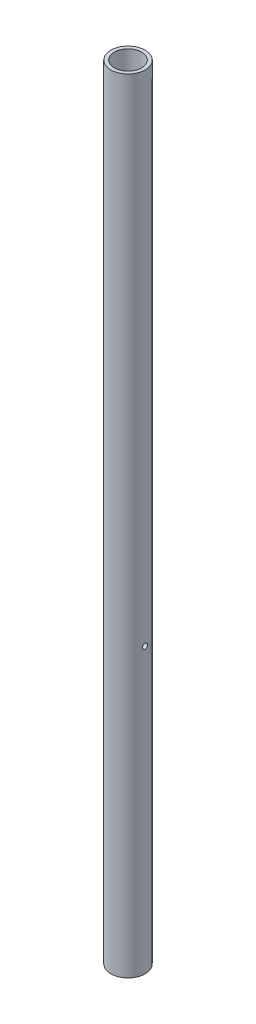
ISO-10303-21;
HEADER;
FILE_DESCRIPTION(('STEP AP214'),'2;1');
FILE_NAME('part.step','',(''),(''),'','','');
FILE_SCHEMA(('AUTOMOTIVE_DESIGN { 1 0 10303 214 1 1 1 1 }'));
ENDSEC;
DATA;
#1=APPLICATION_CONTEXT('core data for automotive mechanical design processes');
#2=APPLICATION_PROTOCOL_DEFINITION('international standard','automotive_design',2000,#1);
#3=PRODUCT_CONTEXT('',#1,'mechanical');
#4=PRODUCT('Part','Part','',(#3));
#5=PRODUCT_RELATED_PRODUCT_CATEGORY('part','',(#4));
#6=PRODUCT_DEFINITION_FORMATION('','',#4);
#7=PRODUCT_DEFINITION_CONTEXT('part definition',#1,'design');
#8=PRODUCT_DEFINITION('design','',#6,#7);
#9=PRODUCT_DEFINITION_SHAPE('','',#8);
#10=(LENGTH_UNIT() NAMED_UNIT(*) SI_UNIT(.MILLI.,.METRE.));
#11=(NAMED_UNIT(*) PLANE_ANGLE_UNIT() SI_UNIT($,.RADIAN.));
#12=(NAMED_UNIT(*) SI_UNIT($,.STERADIAN.) SOLID_ANGLE_UNIT());
#13=UNCERTAINTY_MEASURE_WITH_UNIT(LENGTH_MEASURE(1.E-05),#10,'distance_accuracy_value','');
#14=(GEOMETRIC_REPRESENTATION_CONTEXT(3) GLOBAL_UNCERTAINTY_ASSIGNED_CONTEXT((#13)) GLOBAL_UNIT_ASSIGNED_CONTEXT((#10,
#11,#12)) REPRESENTATION_CONTEXT('',''));
#15=CARTESIAN_POINT('',(0.,0.,0.));
#16=DIRECTION('',(0.,0.,1.));
#17=DIRECTION('',(1.,0.,0.));
#18=AXIS2_PLACEMENT_3D('',#15,#16,#17);
#19=CARTESIAN_POINT('',(0.,-762.,0.));
#20=DIRECTION('',(0.,-1.,0.));
#21=DIRECTION('',(0.,0.,-1.));
#22=AXIS2_PLACEMENT_3D('',#19,#20,#21);
#23=CYLINDRICAL_SURFACE('',#22,13.3223);
#24=CARTESIAN_POINT('',(13.094248102263,-485.896311896024,2.45445389575424));
#25=CARTESIAN_POINT('',(13.0955186791606,-486.033177573124,2.44768393004283));
#26=CARTESIAN_POINT('',(13.0989480892506,-486.169526439796,2.4294352910103));
#27=CARTESIAN_POINT('',(13.1097367075667,-486.437209912402,2.37051786913984));
#28=CARTESIAN_POINT('',(13.1170994419253,-486.568539905657,2.32982896807454));
#29=CARTESIAN_POINT('',(13.1348939660872,-486.822299777622,2.22731391930042));
#30=CARTESIAN_POINT('',(13.1453227891315,-486.944738117777,2.16550819498147));
#31=CARTESIAN_POINT('',(13.1680756823768,-487.177512251901,2.02254266967234));
#32=CARTESIAN_POINT('',(13.1803995743907,-487.287849182058,1.94138468791866));
#33=CARTESIAN_POINT('',(13.2057234855463,-487.494645934029,1.76094154937199));
#34=CARTESIAN_POINT('',(13.2187294693681,-487.590939011952,1.6614660675412));
#35=CARTESIAN_POINT('',(13.2438431523428,-487.765540017535,1.44770736090261));
#36=CARTESIAN_POINT('',(13.2559508092402,-487.843847099527,1.33342344022603));
#37=CARTESIAN_POINT('',(13.2779711460215,-487.980558991197,1.09262168331398));
#38=CARTESIAN_POINT('',(13.2878737084947,-488.038872701134,0.966051133833017));
#39=CARTESIAN_POINT('',(13.3042931753712,-488.133342398027,0.704688100131764));
#40=CARTESIAN_POINT('',(13.3108103916738,-488.169500426289,0.569896374625207));
#41=CARTESIAN_POINT('',(13.3196576802456,-488.218201770463,0.297791777038008));
#42=CARTESIAN_POINT('',(13.3220411477954,-488.231046327095,0.160534555414485));
#43=CARTESIAN_POINT('',(13.3225185635427,-488.233635255758,-0.114199369083345));
#44=CARTESIAN_POINT('',(13.320612802735,-488.223381194871,-0.251676056436081));
#45=CARTESIAN_POINT('',(13.3127670814004,-488.180324310705,-0.521490643613043));
#46=CARTESIAN_POINT('',(13.3068682001921,-488.147751055359,-0.653866501924989));
#47=CARTESIAN_POINT('',(13.2917238406163,-488.061286549074,-0.911256691554743));
#48=CARTESIAN_POINT('',(13.2824781892698,-488.007394196236,-1.03627064198143));
#49=CARTESIAN_POINT('',(13.2615545448244,-487.879333446472,-1.2765277909632));
#50=CARTESIAN_POINT('',(13.2498574086408,-487.805003943778,-1.39168339755751));
#51=CARTESIAN_POINT('',(13.2253497680949,-487.638340106305,-1.60800227237208));
#52=CARTESIAN_POINT('',(13.2125391564742,-487.546004035928,-1.70916419017576));
#53=CARTESIAN_POINT('',(13.1870191403829,-487.344387031095,-1.89611433058584));
#54=CARTESIAN_POINT('',(13.174313749858,-487.234884293187,-1.98166409678471));
#55=CARTESIAN_POINT('',(13.1506307052616,-487.002909114261,-2.13318810091533));
#56=CARTESIAN_POINT('',(13.139653034192,-486.880436800863,-2.19916253144319));
#57=CARTESIAN_POINT('',(13.1207076850191,-486.626110681478,-2.30951399379013));
#58=CARTESIAN_POINT('',(13.1127355479872,-486.494271120613,-2.35392304783903));
#59=CARTESIAN_POINT('',(13.1007201484129,-486.224827828475,-2.4199066158937));
#60=CARTESIAN_POINT('',(13.0966764426535,-486.087224749287,-2.44148370589223));
#61=CARTESIAN_POINT('',(13.0930297957402,-485.812418142652,-2.46096428621845));
#62=CARTESIAN_POINT('',(13.0933598135124,-485.675240752395,-2.4592251660184));
#63=CARTESIAN_POINT('',(13.0982585448134,-485.403160872828,-2.43299692449981));
#64=CARTESIAN_POINT('',(13.102827140668,-485.268258320467,-2.40850843476359));
#65=CARTESIAN_POINT('',(13.1156384395196,-485.005234531561,-2.33772922921322));
#66=CARTESIAN_POINT('',(13.1238623113673,-484.877082256356,-2.29155018981437));
#67=CARTESIAN_POINT('',(13.1430505289193,-484.630310832631,-2.17879644302104));
#68=CARTESIAN_POINT('',(13.1540151020374,-484.511692476283,-2.11222004302297));
#69=CARTESIAN_POINT('',(13.1776294191417,-484.285665395147,-1.95953712919564));
#70=CARTESIAN_POINT('',(13.1902993708158,-484.178424011737,-1.87318602326438));
#71=CARTESIAN_POINT('',(13.2158053161587,-483.979836377772,-1.6838273904015));
#72=CARTESIAN_POINT('',(13.2286413222502,-483.888491323911,-1.58081861058667));
#73=CARTESIAN_POINT('',(13.2532020222888,-483.723290680376,-1.35970569904997));
#74=CARTESIAN_POINT('',(13.2649130238339,-483.649637335378,-1.24144876751076));
#75=CARTESIAN_POINT('',(13.2857441158786,-483.523271462329,-0.994018659490983));
#76=CARTESIAN_POINT('',(13.2948643567712,-483.470557718668,-0.86484611722373));
#77=CARTESIAN_POINT('',(13.3094217348682,-483.388006336459,-0.60030643732196));
#78=CARTESIAN_POINT('',(13.3148873776677,-483.357991401892,-0.464996248088174));
#79=CARTESIAN_POINT('',(13.3216320835144,-483.321105000857,-0.191159340950899));
#80=CARTESIAN_POINT('',(13.3229115444872,-483.314231334649,-0.0526329300324671));
#81=CARTESIAN_POINT('',(13.3211526457135,-483.323774206487,0.221618653861091));
#82=CARTESIAN_POINT('',(13.3181750180303,-483.339863151953,0.3573557566275));
#83=CARTESIAN_POINT('',(13.3083407127711,-483.394238924374,0.624157971647902));
#84=CARTESIAN_POINT('',(13.3014839982312,-483.432525962855,0.755223039369327));
#85=CARTESIAN_POINT('',(13.2846305886335,-483.530206697619,1.00920899497344));
#86=CARTESIAN_POINT('',(13.2746297686051,-483.589628135117,1.13211892553627));
#87=CARTESIAN_POINT('',(13.2525755283095,-483.727860352105,1.36629823432814));
#88=CARTESIAN_POINT('',(13.2405219630152,-483.80667250173,1.47756678919203));
#89=CARTESIAN_POINT('',(13.2154775732462,-483.982816179109,1.68705018368411));
#90=CARTESIAN_POINT('',(13.2024755936137,-484.080402413967,1.78504959049889));
#91=CARTESIAN_POINT('',(13.1771372509761,-484.290681627771,1.96338146001378));
#92=CARTESIAN_POINT('',(13.1648010332379,-484.403377885125,2.04371007868295));
#93=CARTESIAN_POINT('',(13.1421167957647,-484.641535513222,2.18485751769197));
#94=CARTESIAN_POINT('',(13.1317816720822,-484.767072199748,2.24555137951654));
#95=CARTESIAN_POINT('',(13.1144130806487,-485.026718256206,2.34487018117609));
#96=CARTESIAN_POINT('',(13.1073764000531,-485.160819138881,2.38351660429228));
#97=CARTESIAN_POINT('',(13.0988091650531,-485.395651716255,2.43007092758558));
#98=CARTESIAN_POINT('',(13.0962911533853,-485.495281238014,2.44354073659948));
#99=CARTESIAN_POINT('',(13.0935451696192,-485.695470303604,2.45821227178195));
#100=CARTESIAN_POINT('',(13.0933171451085,-485.796029826097,2.45941427873164));
#101=CARTESIAN_POINT('',(13.094248102263,-485.896311896024,2.45445389575424));
#102=B_SPLINE_CURVE_WITH_KNOTS('',3,(#24,#25,#26,#27,#28,#29,#30,#31,#32,#33,#34,#35,#36,#37,
#38,#39,#40,#41,#42,#43,#44,#45,#46,#47,#48,#49,#50,#51,#52,#53,#54,#55,#56,#57,#58,#59,#60,#61,
#62,#63,#64,#65,#66,#67,#68,#69,#70,#71,#72,#73,#74,#75,#76,#77,#78,#79,#80,#81,#82,#83,#84,#85,
#86,#87,#88,#89,#90,#91,#92,#93,#94,#95,#96,#97,#98,#99,#100,#101),.UNSPECIFIED.,.T.,.F.,(4,2,2,
2,2,2,2,2,2,2,2,2,2,2,2,2,2,2,2,2,2,2,2,2,2,2,2,2,2,2,2,2,2,2,2,2,2,2,4),(0.,0.410748221038753,
0.821865287632016,1.2325858576993,1.6432678326058,2.05848606689291,2.47372381993282,
2.89082921181882,3.3078961680674,3.71953462896369,4.13114516384405,4.53858433438119,
4.94604456655955,5.35681374650053,5.7676225388064,6.18425922407537,6.60089181003929,
7.01690383586121,7.43286892054995,7.8424655030256,8.25205071436283,8.65954986216409,
9.06708283401895,9.47995844707794,9.89286512844404,10.3102885307485,10.7276876967821,
11.1417919722248,11.555856883027,11.9640733089576,12.3722936248564,12.7810517642583,
13.1898387945765,13.6046224507508,14.0194962482321,14.4369606697882,14.8540176112865,
15.1549814868096,15.4559384739629),.UNSPECIFIED.);
#103=CARTESIAN_POINT('',(13.094248102263,-485.896311896024,2.45445389575424));
#104=VERTEX_POINT('',#103);
#105=EDGE_CURVE('E57',#104,#104,#102,.T.);
#106=ORIENTED_EDGE('',*,*,#105,.T.);
#107=EDGE_LOOP('',(#106));
#108=FACE_BOUND('',#107,.T.);
#109=CARTESIAN_POINT('',(0.,0.,0.));
#110=DIRECTION('',(0.,-1.,0.));
#111=DIRECTION('',(0.,0.,-1.));
#112=AXIS2_PLACEMENT_3D('',#109,#110,#111);
#113=CIRCLE('',#112,13.3223);
#114=CARTESIAN_POINT('',(0.,0.,-13.3223));
#115=VERTEX_POINT('',#114);
#116=EDGE_CURVE('E68',#115,#115,#113,.F.);
#117=ORIENTED_EDGE('',*,*,#116,.T.);
#118=EDGE_LOOP('',(#117));
#119=FACE_BOUND('',#118,.T.);
#120=CARTESIAN_POINT('',(0.,-762.,0.));
#121=DIRECTION('',(0.,-1.,0.));
#122=DIRECTION('',(0.,0.,-1.));
#123=AXIS2_PLACEMENT_3D('',#120,#121,#122);
#124=CIRCLE('',#123,13.3223);
#125=CARTESIAN_POINT('',(0.,-762.,-13.3223));
#126=VERTEX_POINT('',#125);
#127=EDGE_CURVE('E16',#126,#126,#124,.F.);
#128=ORIENTED_EDGE('',*,*,#127,.F.);
#129=EDGE_LOOP('',(#128));
#130=FACE_BOUND('',#129,.T.);
#131=CARTESIAN_POINT('',(-13.094248102263,-485.653688103976,2.45445389575423));
#132=CARTESIAN_POINT('',(-13.0955186791606,-485.516822426876,2.44768393004281));
#133=CARTESIAN_POINT('',(-13.0989480892506,-485.380473560204,2.42943529101028));
#134=CARTESIAN_POINT('',(-13.1097367075667,-485.112790087598,2.3705178691398));
#135=CARTESIAN_POINT('',(-13.1170994419253,-484.981460094343,2.32982896807449));
#136=CARTESIAN_POINT('',(-13.1348939660872,-484.727700222378,2.22731391930036));
#137=CARTESIAN_POINT('',(-13.1453227891315,-484.605261882223,2.1655081949814));
#138=CARTESIAN_POINT('',(-13.1680756823768,-484.372487748099,2.02254266967224));
#139=CARTESIAN_POINT('',(-13.1803995743907,-484.262150817942,1.94138468791854));
#140=CARTESIAN_POINT('',(-13.2057234855463,-484.055354065971,1.76094154937185));
#141=CARTESIAN_POINT('',(-13.2187294693681,-483.959060988048,1.66146606754106));
#142=CARTESIAN_POINT('',(-13.2438431523429,-483.784459982465,1.44770736090247));
#143=CARTESIAN_POINT('',(-13.2559508092402,-483.706152900473,1.33342344022591));
#144=CARTESIAN_POINT('',(-13.2779711460215,-483.569441008803,1.09262168331386));
#145=CARTESIAN_POINT('',(-13.2878737084947,-483.511127298866,0.966051133832881));
#146=CARTESIAN_POINT('',(-13.3042931753713,-483.416657601973,0.704688100131601));
#147=CARTESIAN_POINT('',(-13.3108103916738,-483.380499573711,0.569896374625029));
#148=CARTESIAN_POINT('',(-13.3196576802456,-483.331798229537,0.297791777037822));
#149=CARTESIAN_POINT('',(-13.3220411477954,-483.318953672905,0.160534555414307));
#150=CARTESIAN_POINT('',(-13.3225185635427,-483.316364744242,-0.11419936908351));
#151=CARTESIAN_POINT('',(-13.320612802735,-483.326618805129,-0.251676056436241));
#152=CARTESIAN_POINT('',(-13.3127670814004,-483.369675689295,-0.521490643613186));
#153=CARTESIAN_POINT('',(-13.3068682001921,-483.402248944641,-0.65386650192512));
#154=CARTESIAN_POINT('',(-13.2917238406163,-483.488713450926,-0.911256691554865));
#155=CARTESIAN_POINT('',(-13.2824781892698,-483.542605803764,-1.03627064198155));
#156=CARTESIAN_POINT('',(-13.2615545448244,-483.670666553528,-1.27652779096332));
#157=CARTESIAN_POINT('',(-13.2498574086408,-483.744996056222,-1.39168339755762));
#158=CARTESIAN_POINT('',(-13.2253497680949,-483.911659893695,-1.60800227237219));
#159=CARTESIAN_POINT('',(-13.2125391564742,-484.003995964072,-1.70916419017587));
#160=CARTESIAN_POINT('',(-13.1870191403829,-484.205612968906,-1.89611433058592));
#161=CARTESIAN_POINT('',(-13.174313749858,-484.315115706813,-1.98166409678478));
#162=CARTESIAN_POINT('',(-13.1506307052616,-484.547090885739,-2.13318810091539));
#163=CARTESIAN_POINT('',(-13.139653034192,-484.669563199137,-2.19916253144327));
#164=CARTESIAN_POINT('',(-13.1207076850191,-484.923889318522,-2.3095139937902));
#165=CARTESIAN_POINT('',(-13.1127355479872,-485.055728879388,-2.3539230478391));
#166=CARTESIAN_POINT('',(-13.1007201484129,-485.325172171525,-2.41990661589374));
#167=CARTESIAN_POINT('',(-13.0966764426535,-485.462775250713,-2.44148370589225));
#168=CARTESIAN_POINT('',(-13.0930297957402,-485.737581857349,-2.46096428621846));
#169=CARTESIAN_POINT('',(-13.0933598135124,-485.874759247605,-2.4592251660184));
#170=CARTESIAN_POINT('',(-13.0982585448134,-486.146839127172,-2.43299692449979));
#171=CARTESIAN_POINT('',(-13.102827140668,-486.281741679533,-2.40850843476355));
#172=CARTESIAN_POINT('',(-13.1156384395196,-486.544765468439,-2.33772922921317));
#173=CARTESIAN_POINT('',(-13.1238623113673,-486.672917743645,-2.29155018981431));
#174=CARTESIAN_POINT('',(-13.1430505289194,-486.919689167369,-2.17879644302097));
#175=CARTESIAN_POINT('',(-13.1540151020374,-487.038307523717,-2.1122200430229));
#176=CARTESIAN_POINT('',(-13.1776294191417,-487.264334604853,-1.95953712919556));
#177=CARTESIAN_POINT('',(-13.1902993708159,-487.371575988263,-1.87318602326429));
#178=CARTESIAN_POINT('',(-13.2158053161587,-487.570163622228,-1.6838273904014));
#179=CARTESIAN_POINT('',(-13.2286413222502,-487.661508676089,-1.58081861058656));
#180=CARTESIAN_POINT('',(-13.2532020222888,-487.826709319624,-1.35970569904987));
#181=CARTESIAN_POINT('',(-13.2649130238339,-487.900362664622,-1.24144876751067));
#182=CARTESIAN_POINT('',(-13.2857441158786,-488.026728537671,-0.994018659490869));
#183=CARTESIAN_POINT('',(-13.2948643567712,-488.079442281332,-0.86484611722359));
#184=CARTESIAN_POINT('',(-13.3094217348682,-488.161993663541,-0.600306437321802));
#185=CARTESIAN_POINT('',(-13.3148873776677,-488.192008598108,-0.464996248088025));
#186=CARTESIAN_POINT('',(-13.3216320835144,-488.228894999143,-0.191159340950756));
#187=CARTESIAN_POINT('',(-13.3229115444872,-488.235768665351,-0.0526329300323216));
#188=CARTESIAN_POINT('',(-13.3211526457135,-488.226225793513,0.221618653861224));
#189=CARTESIAN_POINT('',(-13.3181750180303,-488.210136848047,0.357355756627618));
#190=CARTESIAN_POINT('',(-13.3083407127711,-488.155761075626,0.624157971648018));
#191=CARTESIAN_POINT('',(-13.3014839982312,-488.117474037145,0.755223039369454));
#192=CARTESIAN_POINT('',(-13.2846305886335,-488.019793302381,1.00920899497356));
#193=CARTESIAN_POINT('',(-13.2746297686051,-487.960371864883,1.13211892553638));
#194=CARTESIAN_POINT('',(-13.2525755283095,-487.822139647895,1.36629823432824));
#195=CARTESIAN_POINT('',(-13.2405219630151,-487.74332749827,1.47756678919215));
#196=CARTESIAN_POINT('',(-13.2154775732462,-487.567183820891,1.68705018368421));
#197=CARTESIAN_POINT('',(-13.2024755936136,-487.469597586033,1.78504959049896));
#198=CARTESIAN_POINT('',(-13.1771372509761,-487.259318372229,1.96338146001384));
#199=CARTESIAN_POINT('',(-13.1648010332378,-487.146622114875,2.04371007868303));
#200=CARTESIAN_POINT('',(-13.1421167957647,-486.908464486778,2.18485751769205));
#201=CARTESIAN_POINT('',(-13.1317816720821,-486.782927800251,2.24555137951661));
#202=CARTESIAN_POINT('',(-13.1144130806487,-486.523281743794,2.34487018117613));
#203=CARTESIAN_POINT('',(-13.1073764000531,-486.389180861119,2.38351660429231));
#204=CARTESIAN_POINT('',(-13.0988091650531,-486.154348283745,2.43007092758559));
#205=CARTESIAN_POINT('',(-13.0962911533853,-486.054718761986,2.44354073659948));
#206=CARTESIAN_POINT('',(-13.0935451696192,-485.854529696396,2.45821227178195));
#207=CARTESIAN_POINT('',(-13.0933171451085,-485.753970173903,2.45941427873163));
#208=CARTESIAN_POINT('',(-13.094248102263,-485.653688103976,2.45445389575423));
#209=B_SPLINE_CURVE_WITH_KNOTS('',3,(#131,#132,#133,#134,#135,#136,#137,#138,#139,#140,#141,
#142,#143,#144,#145,#146,#147,#148,#149,#150,#151,#152,#153,#154,#155,#156,#157,#158,#159,#160,
#161,#162,#163,#164,#165,#166,#167,#168,#169,#170,#171,#172,#173,#174,#175,#176,#177,#178,#179,
#180,#181,#182,#183,#184,#185,#186,#187,#188,#189,#190,#191,#192,#193,#194,#195,#196,#197,#198,
#199,#200,#201,#202,#203,#204,#205,#206,#207,#208),.UNSPECIFIED.,.T.,.F.,(4,2,2,2,2,2,2,2,2,2,2,
2,2,2,2,2,2,2,2,2,2,2,2,2,2,2,2,2,2,2,2,2,2,2,2,2,2,2,4),(0.,0.410748221038755,
0.821865287632024,1.23258585769932,1.64326783260591,2.05848606689297,2.47372381993283,
2.89082921181886,3.30789616806747,3.71953462896374,4.13114516384408,4.5385843343812,
4.94604456655957,5.35681374650053,5.76762253880644,6.18425922407538,6.60089181003936,
7.01690383586132,7.43286892055001,7.84246550302565,8.25205071436289,8.65954986216416,
9.06708283401897,9.47995844707797,9.89286512844404,10.3102885307486,10.7276876967821,
11.1417919722248,11.555856883027,11.9640733089576,12.3722936248564,12.7810517642583,
13.1898387945765,13.6046224507508,14.0194962482322,14.4369606697883,14.8540176112865,
15.1549814868096,15.4559384739629),.UNSPECIFIED.);
#210=CARTESIAN_POINT('',(-13.094248102263,-485.653688103976,2.45445389575423));
#211=VERTEX_POINT('',#210);
#212=EDGE_CURVE('E60',#211,#211,#209,.T.);
#213=ORIENTED_EDGE('',*,*,#212,.T.);
#214=EDGE_LOOP('',(#213));
#215=FACE_BOUND('',#214,.T.);
#216=ADVANCED_FACE('F12',(#108,#119,#130,#215),#23,.F.);
#217=CARTESIAN_POINT('',(0.,-762.,0.));
#218=DIRECTION('',(0.,-1.,0.));
#219=DIRECTION('',(0.,0.,-1.));
#220=AXIS2_PLACEMENT_3D('',#217,#218,#219);
#221=PLANE('',#220);
#222=CARTESIAN_POINT('',(0.,-762.,0.));
#223=DIRECTION('',(0.,-1.,0.));
#224=DIRECTION('',(0.,0.,-1.));
#225=AXIS2_PLACEMENT_3D('',#222,#223,#224);
#226=CIRCLE('',#225,16.7005);
#227=CARTESIAN_POINT('',(0.,-762.,-16.7005));
#228=VERTEX_POINT('',#227);
#229=EDGE_CURVE('E55',#228,#228,#226,.F.);
#230=ORIENTED_EDGE('',*,*,#229,.F.);
#231=EDGE_LOOP('',(#230));
#232=FACE_BOUND('',#231,.T.);
#233=ORIENTED_EDGE('',*,*,#127,.T.);
#234=EDGE_LOOP('',(#233));
#235=FACE_BOUND('',#234,.T.);
#236=ADVANCED_FACE('F76',(#232,#235),#221,.T.);
#237=CARTESIAN_POINT('',(0.,0.,0.));
#238=DIRECTION('',(0.,-1.,0.));
#239=DIRECTION('',(0.,0.,-1.));
#240=AXIS2_PLACEMENT_3D('',#237,#238,#239);
#241=PLANE('',#240);
#242=CARTESIAN_POINT('',(0.,0.,0.));
#243=DIRECTION('',(0.,-1.,0.));
#244=DIRECTION('',(0.,0.,-1.));
#245=AXIS2_PLACEMENT_3D('',#242,#243,#244);
#246=CIRCLE('',#245,16.7005);
#247=CARTESIAN_POINT('',(0.,0.,-16.7005));
#248=VERTEX_POINT('',#247);
#249=EDGE_CURVE('E25',#248,#248,#246,.T.);
#250=ORIENTED_EDGE('',*,*,#249,.F.);
#251=EDGE_LOOP('',(#250));
#252=FACE_BOUND('',#251,.T.);
#253=ORIENTED_EDGE('',*,*,#116,.F.);
#254=EDGE_LOOP('',(#253));
#255=FACE_BOUND('',#254,.T.);
#256=ADVANCED_FACE('F72',(#252,#255),#241,.F.);
#257=CARTESIAN_POINT('',(746.266107909946,-485.775,1.37475685413339E-13));
#258=DIRECTION('',(1.,0.,0.));
#259=DIRECTION('',(0.,0.,-1.));
#260=AXIS2_PLACEMENT_3D('',#257,#258,#259);
#261=CYLINDRICAL_SURFACE('',#260,2.45745);
#262=CARTESIAN_POINT('',(-16.5191526638202,-485.896511246803,2.45444403468493));
#263=CARTESIAN_POINT('',(-16.5201643145239,-486.033741573112,2.44764449846652));
#264=CARTESIAN_POINT('',(-16.5228961281567,-486.170469336492,2.42930495839061));
#265=CARTESIAN_POINT('',(-16.5314969362856,-486.438937088507,2.37005959271896));
#266=CARTESIAN_POINT('',(-16.5373690927519,-486.570671906393,2.32913102118941));
#267=CARTESIAN_POINT('',(-16.5515715040404,-486.825250850838,2.22595527933074));
#268=CARTESIAN_POINT('',(-16.55989982223,-486.9481018874,2.16372489884731));
#269=CARTESIAN_POINT('',(-16.5780763150978,-487.181608072875,2.01973521569617));
#270=CARTESIAN_POINT('',(-16.5879242636993,-487.292265031719,1.93797881693983));
#271=CARTESIAN_POINT('',(-16.6081170832378,-487.499124010079,1.75656310318731));
#272=CARTESIAN_POINT('',(-16.618464964736,-487.595218768721,1.65678178923689));
#273=CARTESIAN_POINT('',(-16.638435995744,-487.769345753627,1.44246642846088));
#274=CARTESIAN_POINT('',(-16.648059113991,-487.847377201028,1.32793174582282));
#275=CARTESIAN_POINT('',(-16.6655295582417,-487.983350701097,1.08694108278898));
#276=CARTESIAN_POINT('',(-16.6733718118805,-488.041235614584,0.960452468460254));
#277=CARTESIAN_POINT('',(-16.6863593390874,-488.134897054258,0.699408531924104));
#278=CARTESIAN_POINT('',(-16.6915047708629,-488.170674877365,0.564853683433551));
#279=CARTESIAN_POINT('',(-16.6984849380349,-488.218834778455,0.29269493546969));
#280=CARTESIAN_POINT('',(-16.7003469188881,-488.231409432855,0.155125811228074));
#281=CARTESIAN_POINT('',(-16.700634796982,-488.233366309108,-0.120177043776132));
#282=CARTESIAN_POINT('',(-16.6990608468377,-488.22274956106,-0.257910766956093));
#283=CARTESIAN_POINT('',(-16.6926752053303,-488.178794287915,-0.528705437515445));
#284=CARTESIAN_POINT('',(-16.6878844684641,-488.145602799154,-0.661790799196174));
#285=CARTESIAN_POINT('',(-16.6756162539249,-488.057634940223,-0.920492535412055));
#286=CARTESIAN_POINT('',(-16.6681386806104,-488.002857801677,-1.04610864388389));
#287=CARTESIAN_POINT('',(-16.6512722447284,-487.872946789152,-1.28705598524392));
#288=CARTESIAN_POINT('',(-16.6418734193957,-487.797706099224,-1.40232890713194));
#289=CARTESIAN_POINT('',(-16.622225381754,-487.629110900995,-1.61868614696789));
#290=CARTESIAN_POINT('',(-16.6119761175441,-487.5357552867,-1.71976959793846));
#291=CARTESIAN_POINT('',(-16.5916666740073,-487.332578037806,-1.90582103662419));
#292=CARTESIAN_POINT('',(-16.5816090244323,-487.222615858017,-1.99063590316452));
#293=CARTESIAN_POINT('',(-16.5629167273628,-486.989907062952,-2.14061254074848));
#294=CARTESIAN_POINT('',(-16.5542820676358,-486.867160557587,-2.20577448073851));
#295=CARTESIAN_POINT('',(-16.5394342591104,-486.612477075707,-2.314484432894));
#296=CARTESIAN_POINT('',(-16.5332181722544,-486.480551481083,-2.35805868726646));
#297=CARTESIAN_POINT('',(-16.5239147035733,-486.211146789935,-2.42239809722281));
#298=CARTESIAN_POINT('',(-16.5208271038485,-486.07366808088,-2.44316484136151));
#299=CARTESIAN_POINT('',(-16.5181550749016,-485.798490611219,-2.46116565081578));
#300=CARTESIAN_POINT('',(-16.5185368910976,-485.660806974482,-2.45862646137161));
#301=CARTESIAN_POINT('',(-16.5226784298022,-485.387843995339,-2.43063638285705));
#302=CARTESIAN_POINT('',(-16.526438093882,-485.252564611385,-2.40518589009852));
#303=CARTESIAN_POINT('',(-16.53688736062,-484.988645419909,-2.33225128458944));
#304=CARTESIAN_POINT('',(-16.5435681706881,-484.859986972501,-2.28483326833549));
#305=CARTESIAN_POINT('',(-16.5591040863889,-484.612429924308,-2.16936592563999));
#306=CARTESIAN_POINT('',(-16.5679593114021,-484.49353185987,-2.1013154663809));
#307=CARTESIAN_POINT('',(-16.5869395905917,-484.267783245921,-1.94584154642227));
#308=CARTESIAN_POINT('',(-16.5970747059823,-484.161042529027,-1.85825983746036));
#309=CARTESIAN_POINT('',(-16.6174242224533,-483.96370126604,-1.66649007433634));
#310=CARTESIAN_POINT('',(-16.6276386271798,-483.873101466807,-1.56230125216681));
#311=CARTESIAN_POINT('',(-16.6470782536842,-483.710007423431,-1.33942543431475));
#312=CARTESIAN_POINT('',(-16.6562963611569,-483.637639038246,-1.220645649291));
#313=CARTESIAN_POINT('',(-16.6726252948748,-483.513899894849,-0.972475928070345));
#314=CARTESIAN_POINT('',(-16.6797362029378,-483.462528321349,-0.843086404075146));
#315=CARTESIAN_POINT('',(-16.6910156818831,-483.38252510178,-0.578082222754291));
#316=CARTESIAN_POINT('',(-16.6951996393723,-483.353774439325,-0.442504171898345));
#317=CARTESIAN_POINT('',(-16.7002134017517,-483.319438380995,-0.16838764700399));
#318=CARTESIAN_POINT('',(-16.7010434052197,-483.313851613653,-0.02984934872137));
#319=CARTESIAN_POINT('',(-16.6992640781553,-483.325956835001,0.244936382607006));
#320=CARTESIAN_POINT('',(-16.6966854346302,-483.343441119559,0.381193223198231));
#321=CARTESIAN_POINT('',(-16.6884294334425,-483.400798195285,0.648809809339811));
#322=CARTESIAN_POINT('',(-16.6827520468744,-483.440671195298,0.780169509196828));
#323=CARTESIAN_POINT('',(-16.6689175186466,-483.54169224012,1.0344759810918));
#324=CARTESIAN_POINT('',(-16.6607573538295,-483.602866235297,1.15741227150624));
#325=CARTESIAN_POINT('',(-16.642857239578,-483.744731358126,1.39132389046522));
#326=CARTESIAN_POINT('',(-16.6331172375351,-483.825423135762,1.5022988204924));
#327=CARTESIAN_POINT('',(-16.6130298581877,-484.004934670995,1.7102555559082));
#328=CARTESIAN_POINT('',(-16.602677623345,-484.103918047809,1.80709568504264));
#329=CARTESIAN_POINT('',(-16.582606155809,-484.316784826474,1.9828570203171));
#330=CARTESIAN_POINT('',(-16.5728870649058,-484.430671548804,2.0617742224612));
#331=CARTESIAN_POINT('',(-16.5551493991107,-484.670606115791,2.19968107229135));
#332=CARTESIAN_POINT('',(-16.5471371654741,-484.796696862556,2.25859687644017));
#333=CARTESIAN_POINT('',(-16.5337916568955,-485.057044641506,2.35431426399157));
#334=CARTESIAN_POINT('',(-16.5284555549683,-485.191292887502,2.39113919163662));
#335=CARTESIAN_POINT('',(-16.5222256460018,-485.42129097031,2.4337298204262));
#336=CARTESIAN_POINT('',(-16.5204639706355,-485.515930257505,2.44561083034619));
#337=CARTESIAN_POINT('',(-16.5185767599827,-485.70596399158,2.45832520372111));
#338=CARTESIAN_POINT('',(-16.518451205059,-485.801358429381,2.45915869977201));
#339=CARTESIAN_POINT('',(-16.5191526638202,-485.896511246803,2.45444403468493));
#340=B_SPLINE_CURVE_WITH_KNOTS('',3,(#262,#263,#264,#265,#266,#267,#268,#269,#270,#271,#272,
#273,#274,#275,#276,#277,#278,#279,#280,#281,#282,#283,#284,#285,#286,#287,#288,#289,#290,#291,
#292,#293,#294,#295,#296,#297,#298,#299,#300,#301,#302,#303,#304,#305,#306,#307,#308,#309,#310,
#311,#312,#313,#314,#315,#316,#317,#318,#319,#320,#321,#322,#323,#324,#325,#326,#327,#328,#329,
#330,#331,#332,#333,#334,#335,#336,#337,#338,#339),.UNSPECIFIED.,.T.,.F.,(4,2,2,2,2,2,2,2,2,2,2,
2,2,2,2,2,2,2,2,2,2,2,2,2,2,2,2,2,2,2,2,2,2,2,2,2,2,2,4),(0.,0.411858376636127,
0.824132231043322,1.23608188122825,1.64797030432833,2.06275877603717,2.47756512949058,
2.89353854037336,3.30948754569863,3.72196854978634,4.13443123294654,4.54423282465626,
4.9540490052318,5.36604682631287,5.77806980953358,6.19379857001773,6.60952375658745,
7.02474233581173,7.43993199301422,7.85108655226544,8.26223399964297,8.67215233032946,
9.08209317152488,9.49548463781679,9.90889522723229,10.3250860384975,10.7412606878802,
11.1552307779529,11.5691763577158,11.9794205752047,12.3896686195671,12.8004182157134,
13.2111814926013,13.6258145044391,14.0405400546987,14.456780497826,14.8725803059536,
15.1581582561111,15.4437327786627),.UNSPECIFIED.);
#341=CARTESIAN_POINT('',(-16.5191526638202,-485.896511246803,2.45444403468493));
#342=VERTEX_POINT('',#341);
#343=EDGE_CURVE('E20',#342,#342,#340,.T.);
#344=ORIENTED_EDGE('',*,*,#343,.F.);
#345=EDGE_LOOP('',(#344));
#346=FACE_BOUND('',#345,.T.);
#347=ORIENTED_EDGE('',*,*,#212,.F.);
#348=EDGE_LOOP('',(#347));
#349=FACE_BOUND('',#348,.T.);
#350=ADVANCED_FACE('F45',(#346,#349),#261,.F.);
#351=CARTESIAN_POINT('',(746.266107909946,-485.775,1.37475685413339E-13));
#352=DIRECTION('',(1.,0.,0.));
#353=DIRECTION('',(0.,0.,-1.));
#354=AXIS2_PLACEMENT_3D('',#351,#352,#353);
#355=CYLINDRICAL_SURFACE('',#354,2.45745);
#356=CARTESIAN_POINT('',(16.5191526638202,-485.653488753198,2.45444403468496));
#357=CARTESIAN_POINT('',(16.5201643145239,-485.516258426888,2.44764449846657));
#358=CARTESIAN_POINT('',(16.5228961281567,-485.379530663508,2.42930495839068));
#359=CARTESIAN_POINT('',(16.5314969362855,-485.111062911494,2.37005959271908));
#360=CARTESIAN_POINT('',(16.5373690927518,-484.979328093607,2.32913102118955));
#361=CARTESIAN_POINT('',(16.5515715040404,-484.724749149163,2.22595527933092));
#362=CARTESIAN_POINT('',(16.55989982223,-484.6018981126,2.16372489884751));
#363=CARTESIAN_POINT('',(16.5780763150978,-484.368391927125,2.01973521569642));
#364=CARTESIAN_POINT('',(16.5879242636992,-484.257734968282,1.9379788169401));
#365=CARTESIAN_POINT('',(16.6081170832378,-484.050875989921,1.75656310318762));
#366=CARTESIAN_POINT('',(16.618464964736,-483.95478123128,1.65678178923722));
#367=CARTESIAN_POINT('',(16.638435995744,-483.780654246373,1.44246642846123));
#368=CARTESIAN_POINT('',(16.648059113991,-483.702622798972,1.32793174582317));
#369=CARTESIAN_POINT('',(16.6655295582417,-483.566649298903,1.08694108278935));
#370=CARTESIAN_POINT('',(16.6733718118805,-483.508764385416,0.960452468460649));
#371=CARTESIAN_POINT('',(16.6863593390874,-483.415102945742,0.699408531924536));
#372=CARTESIAN_POINT('',(16.6915047708629,-483.379325122636,0.564853683433995));
#373=CARTESIAN_POINT('',(16.6984849380349,-483.331165221545,0.292694935470145));
#374=CARTESIAN_POINT('',(16.7003469188881,-483.318590567145,0.155125811228528));
#375=CARTESIAN_POINT('',(16.700634796982,-483.316633690892,-0.120177043775693));
#376=CARTESIAN_POINT('',(16.6990608468377,-483.32725043894,-0.257910766955667));
#377=CARTESIAN_POINT('',(16.6926752053303,-483.371205712085,-0.528705437515028));
#378=CARTESIAN_POINT('',(16.6878844684641,-483.404397200846,-0.661790799195754));
#379=CARTESIAN_POINT('',(16.6756162539249,-483.492365059777,-0.920492535411648));
#380=CARTESIAN_POINT('',(16.6681386806104,-483.547142198323,-1.0461086438835));
#381=CARTESIAN_POINT('',(16.6512722447285,-483.677053210848,-1.28705598524358));
#382=CARTESIAN_POINT('',(16.6418734193957,-483.752293900776,-1.40232890713162));
#383=CARTESIAN_POINT('',(16.622225381754,-483.920889099005,-1.61868614696759));
#384=CARTESIAN_POINT('',(16.6119761175441,-484.014244713299,-1.71976959793818));
#385=CARTESIAN_POINT('',(16.5916666740074,-484.217421962194,-1.90582103662391));
#386=CARTESIAN_POINT('',(16.5816090244324,-484.327384141982,-1.99063590316424));
#387=CARTESIAN_POINT('',(16.5629167273628,-484.560092937048,-2.14061254074824));
#388=CARTESIAN_POINT('',(16.5542820676358,-484.682839442412,-2.20577448073831));
#389=CARTESIAN_POINT('',(16.5394342591105,-484.937522924292,-2.31448443289385));
#390=CARTESIAN_POINT('',(16.5332181722544,-485.069448518917,-2.35805868726633));
#391=CARTESIAN_POINT('',(16.5239147035733,-485.338853210065,-2.42239809722273));
#392=CARTESIAN_POINT('',(16.5208271038485,-485.476331919119,-2.44316484136146));
#393=CARTESIAN_POINT('',(16.5181550749016,-485.75150938878,-2.46116565081577));
#394=CARTESIAN_POINT('',(16.5185368910976,-485.889193025517,-2.45862646137162));
#395=CARTESIAN_POINT('',(16.5226784298022,-486.162156004661,-2.4306363828571));
#396=CARTESIAN_POINT('',(16.526438093882,-486.297435388614,-2.4051858900986));
#397=CARTESIAN_POINT('',(16.53688736062,-486.56135458009,-2.33225128458956));
#398=CARTESIAN_POINT('',(16.5435681706881,-486.690013027499,-2.28483326833564));
#399=CARTESIAN_POINT('',(16.5591040863889,-486.937570075691,-2.16936592564019));
#400=CARTESIAN_POINT('',(16.5679593114021,-487.056468140129,-2.10131546638112));
#401=CARTESIAN_POINT('',(16.5869395905917,-487.282216754078,-1.94584154642251));
#402=CARTESIAN_POINT('',(16.5970747059823,-487.388957470973,-1.85825983746062));
#403=CARTESIAN_POINT('',(16.6174242224533,-487.586298733959,-1.66649007433664));
#404=CARTESIAN_POINT('',(16.6276386271798,-487.676898533193,-1.56230125216712));
#405=CARTESIAN_POINT('',(16.6470782536842,-487.839992576568,-1.33942543431506));
#406=CARTESIAN_POINT('',(16.6562963611569,-487.912360961754,-1.22064564929131));
#407=CARTESIAN_POINT('',(16.6726252948747,-488.03610010515,-0.97247592807068));
#408=CARTESIAN_POINT('',(16.6797362029378,-488.087471678651,-0.843086404075517));
#409=CARTESIAN_POINT('',(16.6910156818831,-488.16747489822,-0.578082222754698));
#410=CARTESIAN_POINT('',(16.6951996393723,-488.196225560674,-0.442504171898752));
#411=CARTESIAN_POINT('',(16.7002134017517,-488.230561619005,-0.168387647004399));
#412=CARTESIAN_POINT('',(16.7010434052197,-488.236148386347,-0.0298493487217832));
#413=CARTESIAN_POINT('',(16.6992640781553,-488.224043164999,0.244936382606592));
#414=CARTESIAN_POINT('',(16.6966854346302,-488.206558880441,0.381193223197819));
#415=CARTESIAN_POINT('',(16.6884294334425,-488.149201804715,0.64880980933941));
#416=CARTESIAN_POINT('',(16.6827520468744,-488.109328804702,0.780169509196436));
#417=CARTESIAN_POINT('',(16.6689175186466,-488.00830775988,1.03447598109142));
#418=CARTESIAN_POINT('',(16.6607573538296,-487.947133764703,1.15741227150587));
#419=CARTESIAN_POINT('',(16.6428572395781,-487.805268641874,1.39132389046487));
#420=CARTESIAN_POINT('',(16.6331172375352,-487.724576864238,1.50229882049206));
#421=CARTESIAN_POINT('',(16.6130298581877,-487.545065329006,1.7102555559079));
#422=CARTESIAN_POINT('',(16.602677623345,-487.446081952192,1.80709568504236));
#423=CARTESIAN_POINT('',(16.5826061558091,-487.233215173527,1.98285702031687));
#424=CARTESIAN_POINT('',(16.5728870649058,-487.119328451196,2.06177422246099));
#425=CARTESIAN_POINT('',(16.5551493991107,-486.879393884209,2.19968107229116));
#426=CARTESIAN_POINT('',(16.5471371654741,-486.753303137445,2.25859687643999));
#427=CARTESIAN_POINT('',(16.5337916568955,-486.492955358494,2.35431426399144));
#428=CARTESIAN_POINT('',(16.5284555549684,-486.358707112498,2.39113919163652));
#429=CARTESIAN_POINT('',(16.5222256460018,-486.128709029691,2.43372982042614));
#430=CARTESIAN_POINT('',(16.5204639706355,-486.034069742495,2.44561083034615));
#431=CARTESIAN_POINT('',(16.5185767599827,-485.844036008421,2.4583252037211));
#432=CARTESIAN_POINT('',(16.518451205059,-485.748641570619,2.45915869977202));
#433=CARTESIAN_POINT('',(16.5191526638202,-485.653488753198,2.45444403468496));
#434=B_SPLINE_CURVE_WITH_KNOTS('',3,(#356,#357,#358,#359,#360,#361,#362,#363,#364,#365,#366,
#367,#368,#369,#370,#371,#372,#373,#374,#375,#376,#377,#378,#379,#380,#381,#382,#383,#384,#385,
#386,#387,#388,#389,#390,#391,#392,#393,#394,#395,#396,#397,#398,#399,#400,#401,#402,#403,#404,
#405,#406,#407,#408,#409,#410,#411,#412,#413,#414,#415,#416,#417,#418,#419,#420,#421,#422,#423,
#424,#425,#426,#427,#428,#429,#430,#431,#432,#433),.UNSPECIFIED.,.T.,.F.,(4,2,2,2,2,2,2,2,2,2,2,
2,2,2,2,2,2,2,2,2,2,2,2,2,2,2,2,2,2,2,2,2,2,2,2,2,2,2,4),(0.,0.411858376636118,
0.824132231043291,1.23608188122824,1.64797030432828,2.06275877603712,2.47756512949055,
2.8935385403733,3.30948754569854,3.72196854978628,4.13443123294649,4.54423282465623,
4.95404900523175,5.36604682631284,5.77806980953359,6.19379857001764,6.60952375658742,
7.02474233581166,7.43993199301422,7.85108655226549,8.26223399964295,8.67215233032941,
9.08209317152486,9.49548463781673,9.90889522723228,10.3250860384975,10.7412606878802,
11.1552307779528,11.5691763577158,11.9794205752046,12.3896686195671,12.8004182157134,
13.2111814926013,13.625814504439,14.0405400546987,14.4567804978259,14.8725803059535,
15.1581582561111,15.4437327786627),.UNSPECIFIED.);
#435=CARTESIAN_POINT('',(16.5191526638202,-485.653488753198,2.45444403468496));
#436=VERTEX_POINT('',#435);
#437=EDGE_CURVE('E8',#436,#436,#434,.T.);
#438=ORIENTED_EDGE('',*,*,#437,.F.);
#439=EDGE_LOOP('',(#438));
#440=FACE_BOUND('',#439,.T.);
#441=ORIENTED_EDGE('',*,*,#105,.F.);
#442=EDGE_LOOP('',(#441));
#443=FACE_BOUND('',#442,.T.);
#444=ADVANCED_FACE('F35',(#440,#443),#355,.F.);
#445=CARTESIAN_POINT('',(0.,-762.,0.));
#446=DIRECTION('',(0.,-1.,0.));
#447=DIRECTION('',(0.,0.,-1.));
#448=AXIS2_PLACEMENT_3D('',#445,#446,#447);
#449=CYLINDRICAL_SURFACE('',#448,16.7005);
#450=ORIENTED_EDGE('',*,*,#437,.T.);
#451=EDGE_LOOP('',(#450));
#452=FACE_BOUND('',#451,.T.);
#453=ORIENTED_EDGE('',*,*,#343,.T.);
#454=EDGE_LOOP('',(#453));
#455=FACE_BOUND('',#454,.T.);
#456=ORIENTED_EDGE('',*,*,#249,.T.);
#457=EDGE_LOOP('',(#456));
#458=FACE_BOUND('',#457,.T.);
#459=ORIENTED_EDGE('',*,*,#229,.T.);
#460=EDGE_LOOP('',(#459));
#461=FACE_BOUND('',#460,.T.);
#462=ADVANCED_FACE('F37',(#452,#455,#458,#461),#449,.T.);
#463=CLOSED_SHELL('',(#216,#236,#256,#350,#444,#462));
#464=MANIFOLD_SOLID_BREP('B1',#463);
#465=ADVANCED_BREP_SHAPE_REPRESENTATION('',(#18,#464),#14);
#466=SHAPE_DEFINITION_REPRESENTATION(#9,#465);
ENDSEC;
END-ISO-10303-21;
